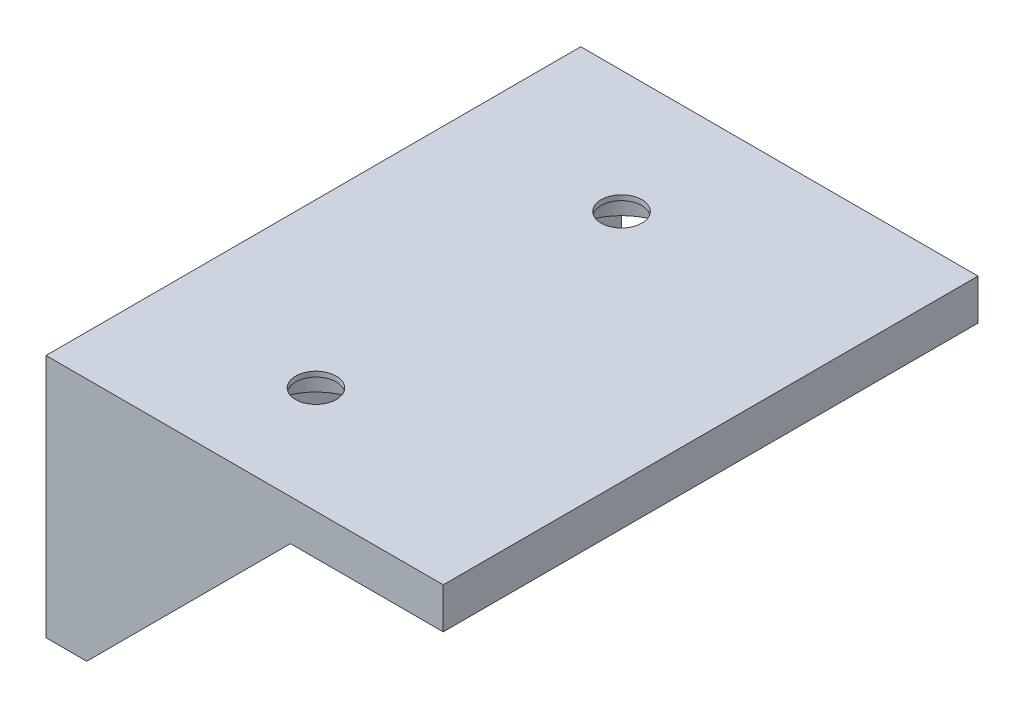
ISO-10303-21;
HEADER;
FILE_DESCRIPTION(('STEP AP214'),'2;1');
FILE_NAME('part.step','',(''),(''),'','','');
FILE_SCHEMA(('AUTOMOTIVE_DESIGN { 1 0 10303 214 1 1 1 1 }'));
ENDSEC;
DATA;
#1=APPLICATION_CONTEXT('core data for automotive mechanical design processes');
#2=APPLICATION_PROTOCOL_DEFINITION('international standard','automotive_design',2000,#1);
#3=PRODUCT_CONTEXT('',#1,'mechanical');
#4=PRODUCT('Part','Part','',(#3));
#5=PRODUCT_RELATED_PRODUCT_CATEGORY('part','',(#4));
#6=PRODUCT_DEFINITION_FORMATION('','',#4);
#7=PRODUCT_DEFINITION_CONTEXT('part definition',#1,'design');
#8=PRODUCT_DEFINITION('design','',#6,#7);
#9=PRODUCT_DEFINITION_SHAPE('','',#8);
#10=(LENGTH_UNIT() NAMED_UNIT(*) SI_UNIT(.MILLI.,.METRE.));
#11=(NAMED_UNIT(*) PLANE_ANGLE_UNIT() SI_UNIT($,.RADIAN.));
#12=(NAMED_UNIT(*) SI_UNIT($,.STERADIAN.) SOLID_ANGLE_UNIT());
#13=UNCERTAINTY_MEASURE_WITH_UNIT(LENGTH_MEASURE(1.E-05),#10,'distance_accuracy_value','');
#14=(GEOMETRIC_REPRESENTATION_CONTEXT(3) GLOBAL_UNCERTAINTY_ASSIGNED_CONTEXT((#13)) GLOBAL_UNIT_ASSIGNED_CONTEXT((#10,
#11,#12)) REPRESENTATION_CONTEXT('',''));
#15=CARTESIAN_POINT('',(0.,0.,0.));
#16=DIRECTION('',(0.,0.,1.));
#17=DIRECTION('',(1.,0.,0.));
#18=AXIS2_PLACEMENT_3D('',#15,#16,#17);
#19=CARTESIAN_POINT('',(0.,-20.,50.));
#20=DIRECTION('',(-1.,0.,0.));
#21=DIRECTION('',(0.,0.,1.));
#22=AXIS2_PLACEMENT_3D('',#19,#20,#21);
#23=PLANE('',#22);
#24=CARTESIAN_POINT('',(0.,-12.,12.));
#25=DIRECTION('',(1.,0.,0.));
#26=DIRECTION('',(0.,0.,1.));
#27=AXIS2_PLACEMENT_3D('',#24,#25,#26);
#28=CIRCLE('',#27,5.15);
#29=CARTESIAN_POINT('',(0.,-12.,17.15));
#30=VERTEX_POINT('',#29);
#31=EDGE_CURVE('E171',#30,#30,#28,.T.);
#32=ORIENTED_EDGE('',*,*,#31,.F.);
#33=EDGE_LOOP('',(#32));
#34=FACE_BOUND('',#33,.T.);
#35=CARTESIAN_POINT('',(0.,-12.,42.));
#36=DIRECTION('',(1.,0.,0.));
#37=DIRECTION('',(0.,0.,-1.));
#38=AXIS2_PLACEMENT_3D('',#35,#36,#37);
#39=CIRCLE('',#38,5.15);
#40=CARTESIAN_POINT('',(0.,-12.,36.85));
#41=VERTEX_POINT('',#40);
#42=EDGE_CURVE('E103',#41,#41,#39,.T.);
#43=ORIENTED_EDGE('',*,*,#42,.F.);
#44=EDGE_LOOP('',(#43));
#45=FACE_BOUND('',#44,.T.);
#46=DIRECTION('',(0.,1.,0.));
#47=VECTOR('',#46,1.);
#48=CARTESIAN_POINT('',(0.,-20.,0.));
#49=LINE('',#48,#47);
#50=CARTESIAN_POINT('',(0.,-20.,0.));
#51=VERTEX_POINT('',#50);
#52=CARTESIAN_POINT('',(0.,0.,0.));
#53=VERTEX_POINT('',#52);
#54=EDGE_CURVE('E93',#51,#53,#49,.T.);
#55=ORIENTED_EDGE('',*,*,#54,.T.);
#56=DIRECTION('',(0.,0.,-1.));
#57=VECTOR('',#56,1.);
#58=CARTESIAN_POINT('',(0.,0.,50.));
#59=LINE('',#58,#57);
#60=CARTESIAN_POINT('',(0.,0.,50.));
#61=VERTEX_POINT('',#60);
#62=EDGE_CURVE('E11',#61,#53,#59,.T.);
#63=ORIENTED_EDGE('',*,*,#62,.F.);
#64=DIRECTION('',(0.,1.,0.));
#65=VECTOR('',#64,1.);
#66=CARTESIAN_POINT('',(0.,-20.,50.));
#67=LINE('',#66,#65);
#68=CARTESIAN_POINT('',(0.,-20.,50.));
#69=VERTEX_POINT('',#68);
#70=EDGE_CURVE('E87',#69,#61,#67,.T.);
#71=ORIENTED_EDGE('',*,*,#70,.F.);
#72=DIRECTION('',(0.,0.,-1.));
#73=VECTOR('',#72,1.);
#74=CARTESIAN_POINT('',(0.,-20.,50.));
#75=LINE('',#74,#73);
#76=EDGE_CURVE('E56',#69,#51,#75,.T.);
#77=ORIENTED_EDGE('',*,*,#76,.T.);
#78=EDGE_LOOP('',(#55,#63,#71,#77));
#79=FACE_BOUND('',#78,.T.);
#80=ADVANCED_FACE('F33',(#34,#45,#79),#23,.F.);
#81=CARTESIAN_POINT('',(0.,0.,50.));
#82=DIRECTION('',(0.,1.,0.));
#83=DIRECTION('',(0.,0.,1.));
#84=AXIS2_PLACEMENT_3D('',#81,#82,#83);
#85=PLANE('',#84);
#86=CARTESIAN_POINT('',(12.,0.,12.));
#87=DIRECTION('',(0.,-1.,0.));
#88=DIRECTION('',(0.,0.,1.));
#89=AXIS2_PLACEMENT_3D('',#86,#87,#88);
#90=CIRCLE('',#89,5.15000000000001);
#91=CARTESIAN_POINT('',(12.,0.,17.15));
#92=VERTEX_POINT('',#91);
#93=EDGE_CURVE('E161',#92,#92,#90,.T.);
#94=ORIENTED_EDGE('',*,*,#93,.F.);
#95=EDGE_LOOP('',(#94));
#96=FACE_BOUND('',#95,.T.);
#97=CARTESIAN_POINT('',(12.,0.,42.));
#98=DIRECTION('',(0.,-1.,0.));
#99=DIRECTION('',(0.,0.,-1.));
#100=AXIS2_PLACEMENT_3D('',#97,#98,#99);
#101=CIRCLE('',#100,5.15);
#102=CARTESIAN_POINT('',(12.,0.,36.85));
#103=VERTEX_POINT('',#102);
#104=EDGE_CURVE('E165',#103,#103,#101,.T.);
#105=ORIENTED_EDGE('',*,*,#104,.F.);
#106=EDGE_LOOP('',(#105));
#107=FACE_BOUND('',#106,.T.);
#108=DIRECTION('',(1.,0.,0.));
#109=VECTOR('',#108,1.);
#110=CARTESIAN_POINT('',(0.,0.,0.));
#111=LINE('',#110,#109);
#112=CARTESIAN_POINT('',(35.,0.,0.));
#113=VERTEX_POINT('',#112);
#114=EDGE_CURVE('E97',#53,#113,#111,.T.);
#115=ORIENTED_EDGE('',*,*,#114,.T.);
#116=DIRECTION('',(0.,0.,-1.));
#117=VECTOR('',#116,1.);
#118=CARTESIAN_POINT('',(35.,0.,50.));
#119=LINE('',#118,#117);
#120=CARTESIAN_POINT('',(35.,0.,52.5));
#121=VERTEX_POINT('',#120);
#122=EDGE_CURVE('E40',#121,#113,#119,.T.);
#123=ORIENTED_EDGE('',*,*,#122,.F.);
#124=DIRECTION('',(1.,0.,0.));
#125=VECTOR('',#124,1.);
#126=CARTESIAN_POINT('',(19.9999999999999,0.,52.5));
#127=LINE('',#126,#125);
#128=CARTESIAN_POINT('',(19.9999999999999,0.,52.5));
#129=VERTEX_POINT('',#128);
#130=EDGE_CURVE('E194',#129,#121,#127,.T.);
#131=ORIENTED_EDGE('',*,*,#130,.F.);
#132=DIRECTION('',(0.,0.,-1.));
#133=VECTOR('',#132,1.);
#134=CARTESIAN_POINT('',(19.9999999999999,0.,52.5));
#135=LINE('',#134,#133);
#136=CARTESIAN_POINT('',(19.9999999999999,0.,50.));
#137=VERTEX_POINT('',#136);
#138=EDGE_CURVE('E146',#129,#137,#135,.T.);
#139=ORIENTED_EDGE('',*,*,#138,.T.);
#140=DIRECTION('',(1.,0.,0.));
#141=VECTOR('',#140,1.);
#142=CARTESIAN_POINT('',(0.,0.,50.));
#143=LINE('',#142,#141);
#144=EDGE_CURVE('E47',#61,#137,#143,.T.);
#145=ORIENTED_EDGE('',*,*,#144,.F.);
#146=ORIENTED_EDGE('',*,*,#62,.T.);
#147=EDGE_LOOP('',(#115,#123,#131,#139,#145,#146));
#148=FACE_BOUND('',#147,.T.);
#149=ADVANCED_FACE('F242',(#96,#107,#148),#85,.F.);
#150=CARTESIAN_POINT('',(35.,0.,50.));
#151=DIRECTION('',(-1.,0.,0.));
#152=DIRECTION('',(0.,0.,1.));
#153=AXIS2_PLACEMENT_3D('',#150,#151,#152);
#154=PLANE('',#153);
#155=DIRECTION('',(0.,1.,0.));
#156=VECTOR('',#155,1.);
#157=CARTESIAN_POINT('',(35.,0.,0.));
#158=LINE('',#157,#156);
#159=CARTESIAN_POINT('',(35.,4.,0.));
#160=VERTEX_POINT('',#159);
#161=EDGE_CURVE('E100',#113,#160,#158,.T.);
#162=ORIENTED_EDGE('',*,*,#161,.T.);
#163=DIRECTION('',(0.,0.,-1.));
#164=VECTOR('',#163,1.);
#165=CARTESIAN_POINT('',(35.,4.,50.));
#166=LINE('',#165,#164);
#167=CARTESIAN_POINT('',(35.,4.,52.5));
#168=VERTEX_POINT('',#167);
#169=EDGE_CURVE('E116',#168,#160,#166,.T.);
#170=ORIENTED_EDGE('',*,*,#169,.F.);
#171=DIRECTION('',(0.,1.,0.));
#172=VECTOR('',#171,1.);
#173=CARTESIAN_POINT('',(35.,0.,52.5));
#174=LINE('',#173,#172);
#175=EDGE_CURVE('E126',#121,#168,#174,.T.);
#176=ORIENTED_EDGE('',*,*,#175,.F.);
#177=ORIENTED_EDGE('',*,*,#122,.T.);
#178=EDGE_LOOP('',(#162,#170,#176,#177));
#179=FACE_BOUND('',#178,.T.);
#180=ADVANCED_FACE('F122',(#179),#154,.F.);
#181=CARTESIAN_POINT('',(35.,4.,50.));
#182=DIRECTION('',(0.,-1.,0.));
#183=DIRECTION('',(1.,0.,0.));
#184=AXIS2_PLACEMENT_3D('',#181,#182,#183);
#185=PLANE('',#184);
#186=CARTESIAN_POINT('',(12.,4.,12.));
#187=DIRECTION('',(0.,-1.,0.));
#188=DIRECTION('',(1.,0.,0.));
#189=AXIS2_PLACEMENT_3D('',#186,#187,#188);
#190=CIRCLE('',#189,2.);
#191=CARTESIAN_POINT('',(14.,4.,12.));
#192=VERTEX_POINT('',#191);
#193=EDGE_CURVE('E204',#192,#192,#190,.T.);
#194=ORIENTED_EDGE('',*,*,#193,.T.);
#195=EDGE_LOOP('',(#194));
#196=FACE_BOUND('',#195,.T.);
#197=CARTESIAN_POINT('',(12.,4.,42.));
#198=DIRECTION('',(0.,-1.,0.));
#199=DIRECTION('',(1.,0.,0.));
#200=AXIS2_PLACEMENT_3D('',#197,#198,#199);
#201=CIRCLE('',#200,2.);
#202=CARTESIAN_POINT('',(14.,4.,42.));
#203=VERTEX_POINT('',#202);
#204=EDGE_CURVE('E157',#203,#203,#201,.T.);
#205=ORIENTED_EDGE('',*,*,#204,.T.);
#206=EDGE_LOOP('',(#205));
#207=FACE_BOUND('',#206,.T.);
#208=DIRECTION('',(-1.,0.,0.));
#209=VECTOR('',#208,1.);
#210=CARTESIAN_POINT('',(35.,4.,0.));
#211=LINE('',#210,#209);
#212=CARTESIAN_POINT('',(-4.,3.99999999999999,0.));
#213=VERTEX_POINT('',#212);
#214=EDGE_CURVE('E109',#160,#213,#211,.T.);
#215=ORIENTED_EDGE('',*,*,#214,.T.);
#216=DIRECTION('',(0.,0.,-1.));
#217=VECTOR('',#216,1.);
#218=CARTESIAN_POINT('',(-4.,3.99999999999999,50.));
#219=LINE('',#218,#217);
#220=CARTESIAN_POINT('',(-4.,3.99999999999999,52.5));
#221=VERTEX_POINT('',#220);
#222=EDGE_CURVE('E113',#221,#213,#219,.T.);
#223=ORIENTED_EDGE('',*,*,#222,.F.);
#224=DIRECTION('',(-1.,0.,0.));
#225=VECTOR('',#224,1.);
#226=CARTESIAN_POINT('',(35.,4.,52.5));
#227=LINE('',#226,#225);
#228=EDGE_CURVE('E147',#168,#221,#227,.T.);
#229=ORIENTED_EDGE('',*,*,#228,.F.);
#230=ORIENTED_EDGE('',*,*,#169,.T.);
#231=EDGE_LOOP('',(#215,#223,#229,#230));
#232=FACE_BOUND('',#231,.T.);
#233=ADVANCED_FACE('F133',(#196,#207,#232),#185,.F.);
#234=CARTESIAN_POINT('',(-4.,3.99999999999999,50.));
#235=DIRECTION('',(1.,0.,0.));
#236=DIRECTION('',(0.,1.,0.));
#237=AXIS2_PLACEMENT_3D('',#234,#235,#236);
#238=PLANE('',#237);
#239=CARTESIAN_POINT('',(-4.,-12.,12.));
#240=DIRECTION('',(1.,0.,0.));
#241=DIRECTION('',(0.,1.,0.));
#242=AXIS2_PLACEMENT_3D('',#239,#240,#241);
#243=CIRCLE('',#242,2.);
#244=CARTESIAN_POINT('',(-4.,-10.,12.));
#245=VERTEX_POINT('',#244);
#246=EDGE_CURVE('E216',#245,#245,#243,.T.);
#247=ORIENTED_EDGE('',*,*,#246,.T.);
#248=EDGE_LOOP('',(#247));
#249=FACE_BOUND('',#248,.T.);
#250=CARTESIAN_POINT('',(-4.,-12.,42.));
#251=DIRECTION('',(1.,0.,0.));
#252=DIRECTION('',(0.,1.,0.));
#253=AXIS2_PLACEMENT_3D('',#250,#251,#252);
#254=CIRCLE('',#253,2.);
#255=CARTESIAN_POINT('',(-4.,-10.,42.));
#256=VERTEX_POINT('',#255);
#257=EDGE_CURVE('E210',#256,#256,#254,.T.);
#258=ORIENTED_EDGE('',*,*,#257,.T.);
#259=EDGE_LOOP('',(#258));
#260=FACE_BOUND('',#259,.T.);
#261=DIRECTION('',(0.,-1.,0.));
#262=VECTOR('',#261,1.);
#263=CARTESIAN_POINT('',(-4.,3.99999999999999,0.));
#264=LINE('',#263,#262);
#265=CARTESIAN_POINT('',(-4.,-20.,0.));
#266=VERTEX_POINT('',#265);
#267=EDGE_CURVE('E88',#213,#266,#264,.T.);
#268=ORIENTED_EDGE('',*,*,#267,.T.);
#269=DIRECTION('',(0.,0.,-1.));
#270=VECTOR('',#269,1.);
#271=CARTESIAN_POINT('',(-4.,-20.,50.));
#272=LINE('',#271,#270);
#273=CARTESIAN_POINT('',(-4.,-20.,52.5));
#274=VERTEX_POINT('',#273);
#275=EDGE_CURVE('E83',#274,#266,#272,.T.);
#276=ORIENTED_EDGE('',*,*,#275,.F.);
#277=DIRECTION('',(0.,-1.,0.));
#278=VECTOR('',#277,1.);
#279=CARTESIAN_POINT('',(-4.,3.99999999999999,52.5));
#280=LINE('',#279,#278);
#281=EDGE_CURVE('E141',#221,#274,#280,.T.);
#282=ORIENTED_EDGE('',*,*,#281,.F.);
#283=ORIENTED_EDGE('',*,*,#222,.T.);
#284=EDGE_LOOP('',(#268,#276,#282,#283));
#285=FACE_BOUND('',#284,.T.);
#286=ADVANCED_FACE('F139',(#249,#260,#285),#238,.F.);
#287=CARTESIAN_POINT('',(-4.,-20.,50.));
#288=DIRECTION('',(0.,1.,0.));
#289=DIRECTION('',(0.,0.,1.));
#290=AXIS2_PLACEMENT_3D('',#287,#288,#289);
#291=PLANE('',#290);
#292=DIRECTION('',(1.,0.,0.));
#293=VECTOR('',#292,1.);
#294=CARTESIAN_POINT('',(-4.,-20.,0.));
#295=LINE('',#294,#293);
#296=EDGE_CURVE('E79',#266,#51,#295,.T.);
#297=ORIENTED_EDGE('',*,*,#296,.T.);
#298=ORIENTED_EDGE('',*,*,#76,.F.);
#299=DIRECTION('',(0.,0.,-1.));
#300=VECTOR('',#299,1.);
#301=CARTESIAN_POINT('',(0.,-20.,52.5));
#302=LINE('',#301,#300);
#303=CARTESIAN_POINT('',(0.,-20.,52.5));
#304=VERTEX_POINT('',#303);
#305=EDGE_CURVE('E150',#304,#69,#302,.T.);
#306=ORIENTED_EDGE('',*,*,#305,.F.);
#307=DIRECTION('',(1.,0.,0.));
#308=VECTOR('',#307,1.);
#309=CARTESIAN_POINT('',(-4.,-20.,52.5));
#310=LINE('',#309,#308);
#311=EDGE_CURVE('E156',#274,#304,#310,.T.);
#312=ORIENTED_EDGE('',*,*,#311,.F.);
#313=ORIENTED_EDGE('',*,*,#275,.T.);
#314=EDGE_LOOP('',(#297,#298,#306,#312,#313));
#315=FACE_BOUND('',#314,.T.);
#316=ADVANCED_FACE('F80',(#315),#291,.F.);
#317=CARTESIAN_POINT('',(0.,0.,0.));
#318=DIRECTION('',(0.,0.,-1.));
#319=DIRECTION('',(-1.,0.,0.));
#320=AXIS2_PLACEMENT_3D('',#317,#318,#319);
#321=PLANE('',#320);
#322=ORIENTED_EDGE('',*,*,#54,.F.);
#323=ORIENTED_EDGE('',*,*,#296,.F.);
#324=ORIENTED_EDGE('',*,*,#267,.F.);
#325=ORIENTED_EDGE('',*,*,#214,.F.);
#326=ORIENTED_EDGE('',*,*,#161,.F.);
#327=ORIENTED_EDGE('',*,*,#114,.F.);
#328=EDGE_LOOP('',(#322,#323,#324,#325,#326,#327));
#329=FACE_BOUND('',#328,.T.);
#330=ADVANCED_FACE('F95',(#329),#321,.T.);
#331=CARTESIAN_POINT('',(-3.5,-12.,42.));
#332=DIRECTION('',(1.,0.,0.));
#333=DIRECTION('',(0.,0.,-1.));
#334=AXIS2_PLACEMENT_3D('',#331,#332,#333);
#335=CYLINDRICAL_SURFACE('',#334,5.15);
#336=CARTESIAN_POINT('',(-3.5,-12.,42.));
#337=DIRECTION('',(1.,0.,0.));
#338=DIRECTION('',(0.,0.,-1.));
#339=AXIS2_PLACEMENT_3D('',#336,#337,#338);
#340=CIRCLE('',#339,5.15);
#341=CARTESIAN_POINT('',(-3.5,-12.,36.85));
#342=VERTEX_POINT('',#341);
#343=EDGE_CURVE('E98',#342,#342,#340,.T.);
#344=ORIENTED_EDGE('',*,*,#343,.F.);
#345=EDGE_LOOP('',(#344));
#346=FACE_BOUND('',#345,.T.);
#347=ORIENTED_EDGE('',*,*,#42,.T.);
#348=EDGE_LOOP('',(#347));
#349=FACE_BOUND('',#348,.T.);
#350=ADVANCED_FACE('F245',(#346,#349),#335,.F.);
#351=CARTESIAN_POINT('',(-3.5,-12.,42.));
#352=DIRECTION('',(1.,0.,0.));
#353=DIRECTION('',(0.,0.,-1.));
#354=AXIS2_PLACEMENT_3D('',#351,#352,#353);
#355=PLANE('',#354);
#356=CARTESIAN_POINT('',(-3.5,-12.,42.));
#357=DIRECTION('',(1.,0.,0.));
#358=DIRECTION('',(0.,0.,-1.));
#359=AXIS2_PLACEMENT_3D('',#356,#357,#358);
#360=CIRCLE('',#359,2.);
#361=CARTESIAN_POINT('',(-3.5,-12.,40.));
#362=VERTEX_POINT('',#361);
#363=EDGE_CURVE('E213',#362,#362,#360,.T.);
#364=ORIENTED_EDGE('',*,*,#363,.F.);
#365=EDGE_LOOP('',(#364));
#366=FACE_BOUND('',#365,.T.);
#367=ORIENTED_EDGE('',*,*,#343,.T.);
#368=EDGE_LOOP('',(#367));
#369=FACE_BOUND('',#368,.T.);
#370=ADVANCED_FACE('F236',(#366,#369),#355,.T.);
#371=CARTESIAN_POINT('',(-3.5,-12.,12.));
#372=DIRECTION('',(1.,0.,0.));
#373=DIRECTION('',(0.,0.,-1.));
#374=AXIS2_PLACEMENT_3D('',#371,#372,#373);
#375=CYLINDRICAL_SURFACE('',#374,5.15);
#376=CARTESIAN_POINT('',(-3.5,-12.,12.));
#377=DIRECTION('',(1.,0.,0.));
#378=DIRECTION('',(0.,0.,1.));
#379=AXIS2_PLACEMENT_3D('',#376,#377,#378);
#380=CIRCLE('',#379,5.15);
#381=CARTESIAN_POINT('',(-3.5,-12.,17.15));
#382=VERTEX_POINT('',#381);
#383=EDGE_CURVE('E174',#382,#382,#380,.T.);
#384=ORIENTED_EDGE('',*,*,#383,.F.);
#385=EDGE_LOOP('',(#384));
#386=FACE_BOUND('',#385,.T.);
#387=ORIENTED_EDGE('',*,*,#31,.T.);
#388=EDGE_LOOP('',(#387));
#389=FACE_BOUND('',#388,.T.);
#390=ADVANCED_FACE('F230',(#386,#389),#375,.F.);
#391=CARTESIAN_POINT('',(-3.5,-12.,12.));
#392=DIRECTION('',(-1.,0.,0.));
#393=DIRECTION('',(0.,0.,1.));
#394=AXIS2_PLACEMENT_3D('',#391,#392,#393);
#395=PLANE('',#394);
#396=CARTESIAN_POINT('',(-3.5,-12.,12.));
#397=DIRECTION('',(1.,0.,0.));
#398=DIRECTION('',(0.,0.,-1.));
#399=AXIS2_PLACEMENT_3D('',#396,#397,#398);
#400=CIRCLE('',#399,2.);
#401=CARTESIAN_POINT('',(-3.5,-12.,10.));
#402=VERTEX_POINT('',#401);
#403=EDGE_CURVE('E219',#402,#402,#400,.T.);
#404=ORIENTED_EDGE('',*,*,#403,.F.);
#405=EDGE_LOOP('',(#404));
#406=FACE_BOUND('',#405,.T.);
#407=ORIENTED_EDGE('',*,*,#383,.T.);
#408=EDGE_LOOP('',(#407));
#409=FACE_BOUND('',#408,.T.);
#410=ADVANCED_FACE('F226',(#406,#409),#395,.F.);
#411=CARTESIAN_POINT('',(12.,3.5,42.));
#412=DIRECTION('',(0.,-1.,0.));
#413=DIRECTION('',(0.,0.,-1.));
#414=AXIS2_PLACEMENT_3D('',#411,#412,#413);
#415=CYLINDRICAL_SURFACE('',#414,5.15);
#416=CARTESIAN_POINT('',(12.,3.5,42.));
#417=DIRECTION('',(0.,-1.,0.));
#418=DIRECTION('',(0.,0.,-1.));
#419=AXIS2_PLACEMENT_3D('',#416,#417,#418);
#420=CIRCLE('',#419,5.15);
#421=CARTESIAN_POINT('',(12.,3.5,36.85));
#422=VERTEX_POINT('',#421);
#423=EDGE_CURVE('E168',#422,#422,#420,.T.);
#424=ORIENTED_EDGE('',*,*,#423,.F.);
#425=EDGE_LOOP('',(#424));
#426=FACE_BOUND('',#425,.T.);
#427=ORIENTED_EDGE('',*,*,#104,.T.);
#428=EDGE_LOOP('',(#427));
#429=FACE_BOUND('',#428,.T.);
#430=ADVANCED_FACE('F229',(#426,#429),#415,.F.);
#431=CARTESIAN_POINT('',(12.,3.5,42.));
#432=DIRECTION('',(0.,-1.,0.));
#433=DIRECTION('',(0.,0.,-1.));
#434=AXIS2_PLACEMENT_3D('',#431,#432,#433);
#435=PLANE('',#434);
#436=CARTESIAN_POINT('',(12.,3.5,42.));
#437=DIRECTION('',(0.,-1.,0.));
#438=DIRECTION('',(0.,0.,-1.));
#439=AXIS2_PLACEMENT_3D('',#436,#437,#438);
#440=CIRCLE('',#439,2.);
#441=CARTESIAN_POINT('',(12.,3.5,40.));
#442=VERTEX_POINT('',#441);
#443=EDGE_CURVE('E201',#442,#442,#440,.T.);
#444=ORIENTED_EDGE('',*,*,#443,.F.);
#445=EDGE_LOOP('',(#444));
#446=FACE_BOUND('',#445,.T.);
#447=ORIENTED_EDGE('',*,*,#423,.T.);
#448=EDGE_LOOP('',(#447));
#449=FACE_BOUND('',#448,.T.);
#450=ADVANCED_FACE('F276',(#446,#449),#435,.T.);
#451=CARTESIAN_POINT('',(12.,3.5,12.));
#452=DIRECTION('',(0.,-1.,0.));
#453=DIRECTION('',(0.,0.,-1.));
#454=AXIS2_PLACEMENT_3D('',#451,#452,#453);
#455=CYLINDRICAL_SURFACE('',#454,5.15000000000001);
#456=CARTESIAN_POINT('',(12.,3.5,12.));
#457=DIRECTION('',(0.,-1.,0.));
#458=DIRECTION('',(0.,0.,1.));
#459=AXIS2_PLACEMENT_3D('',#456,#457,#458);
#460=CIRCLE('',#459,5.15000000000001);
#461=CARTESIAN_POINT('',(12.,3.5,17.15));
#462=VERTEX_POINT('',#461);
#463=EDGE_CURVE('E162',#462,#462,#460,.T.);
#464=ORIENTED_EDGE('',*,*,#463,.F.);
#465=EDGE_LOOP('',(#464));
#466=FACE_BOUND('',#465,.T.);
#467=ORIENTED_EDGE('',*,*,#93,.T.);
#468=EDGE_LOOP('',(#467));
#469=FACE_BOUND('',#468,.T.);
#470=ADVANCED_FACE('F282',(#466,#469),#455,.F.);
#471=CARTESIAN_POINT('',(12.,3.5,12.));
#472=DIRECTION('',(0.,1.,0.));
#473=DIRECTION('',(0.,0.,1.));
#474=AXIS2_PLACEMENT_3D('',#471,#472,#473);
#475=PLANE('',#474);
#476=CARTESIAN_POINT('',(12.,3.5,12.));
#477=DIRECTION('',(0.,-1.,0.));
#478=DIRECTION('',(0.,0.,-1.));
#479=AXIS2_PLACEMENT_3D('',#476,#477,#478);
#480=CIRCLE('',#479,2.);
#481=CARTESIAN_POINT('',(12.,3.5,9.99999999999999));
#482=VERTEX_POINT('',#481);
#483=EDGE_CURVE('E207',#482,#482,#480,.T.);
#484=ORIENTED_EDGE('',*,*,#483,.F.);
#485=EDGE_LOOP('',(#484));
#486=FACE_BOUND('',#485,.T.);
#487=ORIENTED_EDGE('',*,*,#463,.T.);
#488=EDGE_LOOP('',(#487));
#489=FACE_BOUND('',#488,.T.);
#490=ADVANCED_FACE('F289',(#486,#489),#475,.F.);
#491=CARTESIAN_POINT('',(0.,0.,50.));
#492=DIRECTION('',(0.,0.,1.));
#493=DIRECTION('',(1.,0.,0.));
#494=AXIS2_PLACEMENT_3D('',#491,#492,#493);
#495=PLANE('',#494);
#496=DIRECTION('',(0.707106781186546,0.707106781186549,0.));
#497=VECTOR('',#496,1.);
#498=CARTESIAN_POINT('',(0.,-20.,50.));
#499=LINE('',#498,#497);
#500=EDGE_CURVE('E155',#69,#137,#499,.T.);
#501=ORIENTED_EDGE('',*,*,#500,.F.);
#502=ORIENTED_EDGE('',*,*,#70,.T.);
#503=ORIENTED_EDGE('',*,*,#144,.T.);
#504=EDGE_LOOP('',(#501,#502,#503));
#505=FACE_BOUND('',#504,.T.);
#506=ADVANCED_FACE('F180',(#505),#495,.F.);
#507=CARTESIAN_POINT('',(0.,-20.,52.5));
#508=DIRECTION('',(-0.707106781186549,0.707106781186546,0.));
#509=DIRECTION('',(-0.707106781186546,-0.707106781186549,0.));
#510=AXIS2_PLACEMENT_3D('',#507,#508,#509);
#511=PLANE('',#510);
#512=ORIENTED_EDGE('',*,*,#500,.T.);
#513=ORIENTED_EDGE('',*,*,#138,.F.);
#514=DIRECTION('',(0.707106781186546,0.707106781186549,0.));
#515=VECTOR('',#514,1.);
#516=CARTESIAN_POINT('',(0.,-20.,52.5));
#517=LINE('',#516,#515);
#518=EDGE_CURVE('E187',#304,#129,#517,.T.);
#519=ORIENTED_EDGE('',*,*,#518,.F.);
#520=ORIENTED_EDGE('',*,*,#305,.T.);
#521=EDGE_LOOP('',(#512,#513,#519,#520));
#522=FACE_BOUND('',#521,.T.);
#523=ADVANCED_FACE('F184',(#522),#511,.F.);
#524=CARTESIAN_POINT('',(0.,0.,52.5));
#525=DIRECTION('',(0.,0.,1.));
#526=DIRECTION('',(1.,0.,0.));
#527=AXIS2_PLACEMENT_3D('',#524,#525,#526);
#528=PLANE('',#527);
#529=ORIENTED_EDGE('',*,*,#311,.T.);
#530=ORIENTED_EDGE('',*,*,#518,.T.);
#531=ORIENTED_EDGE('',*,*,#130,.T.);
#532=ORIENTED_EDGE('',*,*,#175,.T.);
#533=ORIENTED_EDGE('',*,*,#228,.T.);
#534=ORIENTED_EDGE('',*,*,#281,.T.);
#535=EDGE_LOOP('',(#529,#530,#531,#532,#533,#534));
#536=FACE_BOUND('',#535,.T.);
#537=ADVANCED_FACE('F193',(#536),#528,.T.);
#538=CARTESIAN_POINT('',(12.,13.5,42.));
#539=DIRECTION('',(0.,-1.,0.));
#540=DIRECTION('',(0.,0.,-1.));
#541=AXIS2_PLACEMENT_3D('',#538,#539,#540);
#542=CYLINDRICAL_SURFACE('',#541,2.);
#543=ORIENTED_EDGE('',*,*,#443,.T.);
#544=EDGE_LOOP('',(#543));
#545=FACE_BOUND('',#544,.T.);
#546=ORIENTED_EDGE('',*,*,#204,.F.);
#547=EDGE_LOOP('',(#546));
#548=FACE_BOUND('',#547,.T.);
#549=ADVANCED_FACE('F300',(#545,#548),#542,.F.);
#550=CARTESIAN_POINT('',(12.,13.5,12.));
#551=DIRECTION('',(0.,-1.,0.));
#552=DIRECTION('',(0.,0.,-1.));
#553=AXIS2_PLACEMENT_3D('',#550,#551,#552);
#554=CYLINDRICAL_SURFACE('',#553,2.);
#555=ORIENTED_EDGE('',*,*,#483,.T.);
#556=EDGE_LOOP('',(#555));
#557=FACE_BOUND('',#556,.T.);
#558=ORIENTED_EDGE('',*,*,#193,.F.);
#559=EDGE_LOOP('',(#558));
#560=FACE_BOUND('',#559,.T.);
#561=ADVANCED_FACE('F303',(#557,#560),#554,.F.);
#562=CARTESIAN_POINT('',(-13.5,-12.,42.));
#563=DIRECTION('',(1.,0.,0.));
#564=DIRECTION('',(0.,0.,-1.));
#565=AXIS2_PLACEMENT_3D('',#562,#563,#564);
#566=CYLINDRICAL_SURFACE('',#565,2.);
#567=ORIENTED_EDGE('',*,*,#363,.T.);
#568=EDGE_LOOP('',(#567));
#569=FACE_BOUND('',#568,.T.);
#570=ORIENTED_EDGE('',*,*,#257,.F.);
#571=EDGE_LOOP('',(#570));
#572=FACE_BOUND('',#571,.T.);
#573=ADVANCED_FACE('F307',(#569,#572),#566,.F.);
#574=CARTESIAN_POINT('',(-13.5,-12.,12.));
#575=DIRECTION('',(1.,0.,0.));
#576=DIRECTION('',(0.,0.,-1.));
#577=AXIS2_PLACEMENT_3D('',#574,#575,#576);
#578=CYLINDRICAL_SURFACE('',#577,2.);
#579=ORIENTED_EDGE('',*,*,#403,.T.);
#580=EDGE_LOOP('',(#579));
#581=FACE_BOUND('',#580,.T.);
#582=ORIENTED_EDGE('',*,*,#246,.F.);
#583=EDGE_LOOP('',(#582));
#584=FACE_BOUND('',#583,.T.);
#585=ADVANCED_FACE('F223',(#581,#584),#578,.F.);
#586=CLOSED_SHELL('',(#80,#149,#180,#233,#286,#316,#330,#350,#370,#390,#410,#430,#450,#470,#490,
#506,#523,#537,#549,#561,#573,#585));
#587=MANIFOLD_SOLID_BREP('B2',#586);
#588=ADVANCED_BREP_SHAPE_REPRESENTATION('',(#18,#587),#14);
#589=SHAPE_DEFINITION_REPRESENTATION(#9,#588);
ENDSEC;
END-ISO-10303-21;
